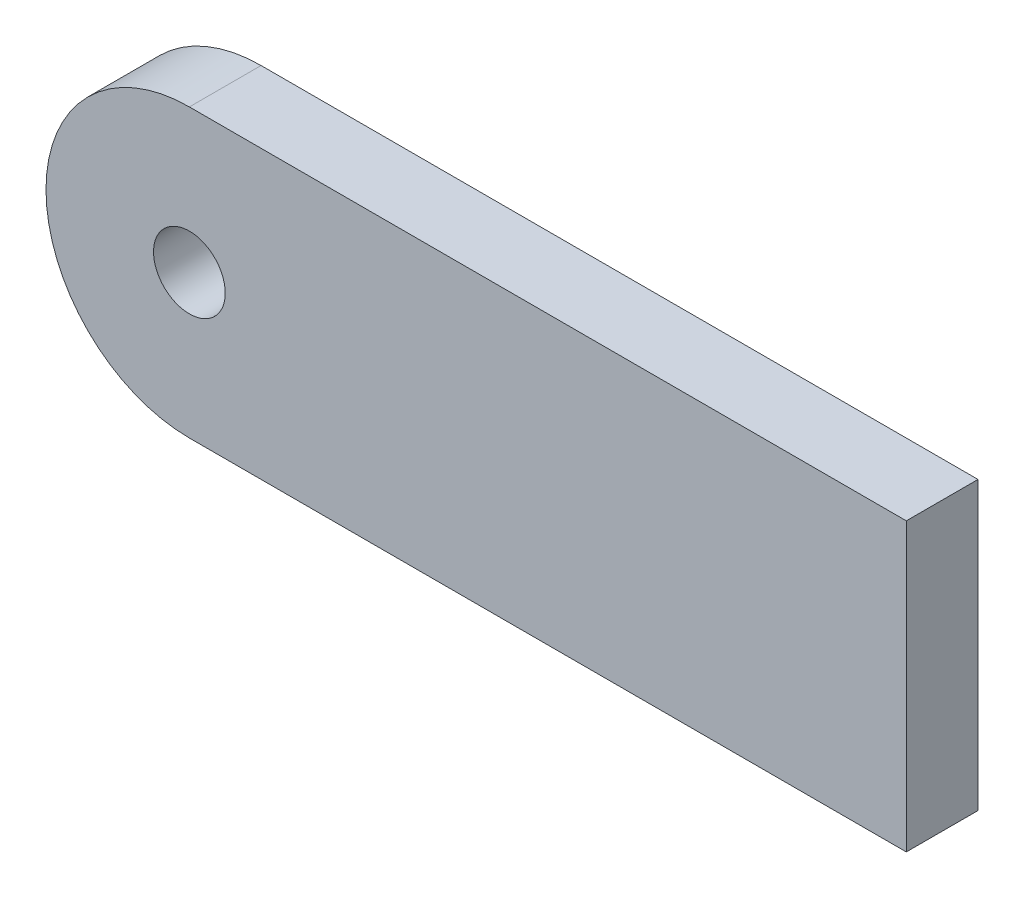
ISO-10303-21;
HEADER;
FILE_DESCRIPTION(('STEP AP214'),'2;1');
FILE_NAME('part.step','',(''),(''),'','','');
FILE_SCHEMA(('AUTOMOTIVE_DESIGN { 1 0 10303 214 1 1 1 1 }'));
ENDSEC;
DATA;
#1=APPLICATION_CONTEXT('core data for automotive mechanical design processes');
#2=APPLICATION_PROTOCOL_DEFINITION('international standard','automotive_design',2000,#1);
#3=PRODUCT_CONTEXT('',#1,'mechanical');
#4=PRODUCT('Part','Part','',(#3));
#5=PRODUCT_RELATED_PRODUCT_CATEGORY('part','',(#4));
#6=PRODUCT_DEFINITION_FORMATION('','',#4);
#7=PRODUCT_DEFINITION_CONTEXT('part definition',#1,'design');
#8=PRODUCT_DEFINITION('design','',#6,#7);
#9=PRODUCT_DEFINITION_SHAPE('','',#8);
#10=(LENGTH_UNIT() NAMED_UNIT(*) SI_UNIT(.MILLI.,.METRE.));
#11=(NAMED_UNIT(*) PLANE_ANGLE_UNIT() SI_UNIT($,.RADIAN.));
#12=(NAMED_UNIT(*) SI_UNIT($,.STERADIAN.) SOLID_ANGLE_UNIT());
#13=UNCERTAINTY_MEASURE_WITH_UNIT(LENGTH_MEASURE(1.E-05),#10,'distance_accuracy_value','');
#14=(GEOMETRIC_REPRESENTATION_CONTEXT(3) GLOBAL_UNCERTAINTY_ASSIGNED_CONTEXT((#13)) GLOBAL_UNIT_ASSIGNED_CONTEXT((#10,
#11,#12)) REPRESENTATION_CONTEXT('',''));
#15=CARTESIAN_POINT('',(0.,0.,0.));
#16=DIRECTION('',(0.,0.,1.));
#17=DIRECTION('',(1.,0.,0.));
#18=AXIS2_PLACEMENT_3D('',#15,#16,#17);
#19=CARTESIAN_POINT('',(-31.75,-6.35,3.175));
#20=DIRECTION('',(0.,0.,1.));
#21=DIRECTION('',(1.,0.,0.));
#22=AXIS2_PLACEMENT_3D('',#19,#20,#21);
#23=PLANE('',#22);
#24=DIRECTION('',(0.,1.,0.));
#25=VECTOR('',#24,1.);
#26=CARTESIAN_POINT('',(0.,0.,3.175));
#27=LINE('',#26,#25);
#28=CARTESIAN_POINT('',(0.,-12.7,3.175));
#29=VERTEX_POINT('',#28);
#30=CARTESIAN_POINT('',(0.,0.,3.175));
#31=VERTEX_POINT('',#30);
#32=EDGE_CURVE('E85',#29,#31,#27,.T.);
#33=ORIENTED_EDGE('',*,*,#32,.T.);
#34=DIRECTION('',(-1.,0.,0.));
#35=VECTOR('',#34,1.);
#36=CARTESIAN_POINT('',(0.,0.,3.175));
#37=LINE('',#36,#35);
#38=CARTESIAN_POINT('',(-31.75,0.,3.175));
#39=VERTEX_POINT('',#38);
#40=EDGE_CURVE('E80',#31,#39,#37,.T.);
#41=ORIENTED_EDGE('',*,*,#40,.T.);
#42=CARTESIAN_POINT('',(-31.75,-6.35,3.175));
#43=DIRECTION('',(0.,0.,1.));
#44=DIRECTION('',(1.,0.,0.));
#45=AXIS2_PLACEMENT_3D('',#42,#43,#44);
#46=CIRCLE('',#45,6.35);
#47=CARTESIAN_POINT('',(-31.75,-12.7,3.175));
#48=VERTEX_POINT('',#47);
#49=EDGE_CURVE('E83',#39,#48,#46,.T.);
#50=ORIENTED_EDGE('',*,*,#49,.T.);
#51=DIRECTION('',(1.,0.,0.));
#52=VECTOR('',#51,1.);
#53=CARTESIAN_POINT('',(0.,-12.7,3.175));
#54=LINE('',#53,#52);
#55=EDGE_CURVE('E50',#48,#29,#54,.T.);
#56=ORIENTED_EDGE('',*,*,#55,.T.);
#57=EDGE_LOOP('',(#33,#41,#50,#56));
#58=FACE_BOUND('',#57,.T.);
#59=CARTESIAN_POINT('',(-31.75,-6.35,3.175));
#60=DIRECTION('',(0.,0.,1.));
#61=DIRECTION('',(1.,0.,0.));
#62=AXIS2_PLACEMENT_3D('',#59,#60,#61);
#63=CIRCLE('',#62,1.5875);
#64=CARTESIAN_POINT('',(-30.1625,-6.35,3.175));
#65=VERTEX_POINT('',#64);
#66=EDGE_CURVE('E100',#65,#65,#63,.T.);
#67=ORIENTED_EDGE('',*,*,#66,.F.);
#68=EDGE_LOOP('',(#67));
#69=FACE_BOUND('',#68,.T.);
#70=ADVANCED_FACE('F33',(#58,#69),#23,.T.);
#71=CARTESIAN_POINT('',(-31.75,-6.35,0.));
#72=DIRECTION('',(0.,0.,1.));
#73=DIRECTION('',(1.,0.,0.));
#74=AXIS2_PLACEMENT_3D('',#71,#72,#73);
#75=PLANE('',#74);
#76=DIRECTION('',(0.,1.,0.));
#77=VECTOR('',#76,1.);
#78=CARTESIAN_POINT('',(0.,0.,0.));
#79=LINE('',#78,#77);
#80=CARTESIAN_POINT('',(0.,-12.7,0.));
#81=VERTEX_POINT('',#80);
#82=CARTESIAN_POINT('',(0.,0.,0.));
#83=VERTEX_POINT('',#82);
#84=EDGE_CURVE('E97',#81,#83,#79,.T.);
#85=ORIENTED_EDGE('',*,*,#84,.F.);
#86=DIRECTION('',(1.,0.,0.));
#87=VECTOR('',#86,1.);
#88=CARTESIAN_POINT('',(0.,-12.7,0.));
#89=LINE('',#88,#87);
#90=CARTESIAN_POINT('',(-31.75,-12.7,0.));
#91=VERTEX_POINT('',#90);
#92=EDGE_CURVE('E73',#91,#81,#89,.T.);
#93=ORIENTED_EDGE('',*,*,#92,.F.);
#94=CARTESIAN_POINT('',(-31.75,-6.35,0.));
#95=DIRECTION('',(0.,0.,1.));
#96=DIRECTION('',(1.,0.,0.));
#97=AXIS2_PLACEMENT_3D('',#94,#95,#96);
#98=CIRCLE('',#97,6.35);
#99=CARTESIAN_POINT('',(-31.75,0.,0.));
#100=VERTEX_POINT('',#99);
#101=EDGE_CURVE('E67',#100,#91,#98,.T.);
#102=ORIENTED_EDGE('',*,*,#101,.F.);
#103=DIRECTION('',(-1.,0.,0.));
#104=VECTOR('',#103,1.);
#105=CARTESIAN_POINT('',(0.,0.,0.));
#106=LINE('',#105,#104);
#107=EDGE_CURVE('E89',#83,#100,#106,.T.);
#108=ORIENTED_EDGE('',*,*,#107,.F.);
#109=EDGE_LOOP('',(#85,#93,#102,#108));
#110=FACE_BOUND('',#109,.T.);
#111=CARTESIAN_POINT('',(-31.75,-6.35,0.));
#112=DIRECTION('',(0.,0.,1.));
#113=DIRECTION('',(1.,0.,0.));
#114=AXIS2_PLACEMENT_3D('',#111,#112,#113);
#115=CIRCLE('',#114,1.5875);
#116=CARTESIAN_POINT('',(-30.1625,-6.35,0.));
#117=VERTEX_POINT('',#116);
#118=EDGE_CURVE('E112',#117,#117,#115,.T.);
#119=ORIENTED_EDGE('',*,*,#118,.T.);
#120=EDGE_LOOP('',(#119));
#121=FACE_BOUND('',#120,.T.);
#122=ADVANCED_FACE('F108',(#110,#121),#75,.F.);
#123=CARTESIAN_POINT('',(0.,0.,3.175));
#124=DIRECTION('',(-1.,0.,0.));
#125=DIRECTION('',(0.,0.,1.));
#126=AXIS2_PLACEMENT_3D('',#123,#124,#125);
#127=PLANE('',#126);
#128=ORIENTED_EDGE('',*,*,#84,.T.);
#129=DIRECTION('',(0.,0.,-1.));
#130=VECTOR('',#129,1.);
#131=CARTESIAN_POINT('',(0.,0.,3.175));
#132=LINE('',#131,#130);
#133=EDGE_CURVE('E11',#31,#83,#132,.T.);
#134=ORIENTED_EDGE('',*,*,#133,.F.);
#135=ORIENTED_EDGE('',*,*,#32,.F.);
#136=DIRECTION('',(0.,0.,-1.));
#137=VECTOR('',#136,1.);
#138=CARTESIAN_POINT('',(0.,-12.7,3.175));
#139=LINE('',#138,#137);
#140=EDGE_CURVE('E93',#29,#81,#139,.T.);
#141=ORIENTED_EDGE('',*,*,#140,.T.);
#142=EDGE_LOOP('',(#128,#134,#135,#141));
#143=FACE_BOUND('',#142,.T.);
#144=ADVANCED_FACE('F35',(#143),#127,.F.);
#145=CARTESIAN_POINT('',(0.,0.,3.175));
#146=DIRECTION('',(0.,-1.,0.));
#147=DIRECTION('',(1.,0.,0.));
#148=AXIS2_PLACEMENT_3D('',#145,#146,#147);
#149=PLANE('',#148);
#150=ORIENTED_EDGE('',*,*,#107,.T.);
#151=DIRECTION('',(0.,0.,-1.));
#152=VECTOR('',#151,1.);
#153=CARTESIAN_POINT('',(-31.75,0.,3.175));
#154=LINE('',#153,#152);
#155=EDGE_CURVE('E42',#39,#100,#154,.T.);
#156=ORIENTED_EDGE('',*,*,#155,.F.);
#157=ORIENTED_EDGE('',*,*,#40,.F.);
#158=ORIENTED_EDGE('',*,*,#133,.T.);
#159=EDGE_LOOP('',(#150,#156,#157,#158));
#160=FACE_BOUND('',#159,.T.);
#161=ADVANCED_FACE('F88',(#160),#149,.F.);
#162=CARTESIAN_POINT('',(-31.75,-6.35,3.175));
#163=DIRECTION('',(0.,0.,-1.));
#164=DIRECTION('',(-1.,0.,0.));
#165=AXIS2_PLACEMENT_3D('',#162,#163,#164);
#166=CYLINDRICAL_SURFACE('',#165,6.35);
#167=ORIENTED_EDGE('',*,*,#101,.T.);
#168=DIRECTION('',(0.,0.,-1.));
#169=VECTOR('',#168,1.);
#170=CARTESIAN_POINT('',(-31.75,-12.7,3.175));
#171=LINE('',#170,#169);
#172=EDGE_CURVE('E90',#48,#91,#171,.T.);
#173=ORIENTED_EDGE('',*,*,#172,.F.);
#174=ORIENTED_EDGE('',*,*,#49,.F.);
#175=ORIENTED_EDGE('',*,*,#155,.T.);
#176=EDGE_LOOP('',(#167,#173,#174,#175));
#177=FACE_BOUND('',#176,.T.);
#178=ADVANCED_FACE('F91',(#177),#166,.T.);
#179=CARTESIAN_POINT('',(0.,-12.7,3.175));
#180=DIRECTION('',(0.,1.,0.));
#181=DIRECTION('',(-1.,0.,0.));
#182=AXIS2_PLACEMENT_3D('',#179,#180,#181);
#183=PLANE('',#182);
#184=ORIENTED_EDGE('',*,*,#92,.T.);
#185=ORIENTED_EDGE('',*,*,#140,.F.);
#186=ORIENTED_EDGE('',*,*,#55,.F.);
#187=ORIENTED_EDGE('',*,*,#172,.T.);
#188=EDGE_LOOP('',(#184,#185,#186,#187));
#189=FACE_BOUND('',#188,.T.);
#190=ADVANCED_FACE('F105',(#189),#183,.F.);
#191=CARTESIAN_POINT('',(-31.75,-6.35,3.175));
#192=DIRECTION('',(0.,0.,-1.));
#193=DIRECTION('',(-1.,0.,0.));
#194=AXIS2_PLACEMENT_3D('',#191,#192,#193);
#195=CYLINDRICAL_SURFACE('',#194,1.5875);
#196=ORIENTED_EDGE('',*,*,#66,.T.);
#197=EDGE_LOOP('',(#196));
#198=FACE_BOUND('',#197,.T.);
#199=ORIENTED_EDGE('',*,*,#118,.F.);
#200=EDGE_LOOP('',(#199));
#201=FACE_BOUND('',#200,.T.);
#202=ADVANCED_FACE('F118',(#198,#201),#195,.F.);
#203=CLOSED_SHELL('',(#70,#122,#144,#161,#178,#190,#202));
#204=MANIFOLD_SOLID_BREP('B2',#203);
#205=ADVANCED_BREP_SHAPE_REPRESENTATION('',(#18,#204),#14);
#206=SHAPE_DEFINITION_REPRESENTATION(#9,#205);
ENDSEC;
END-ISO-10303-21;
